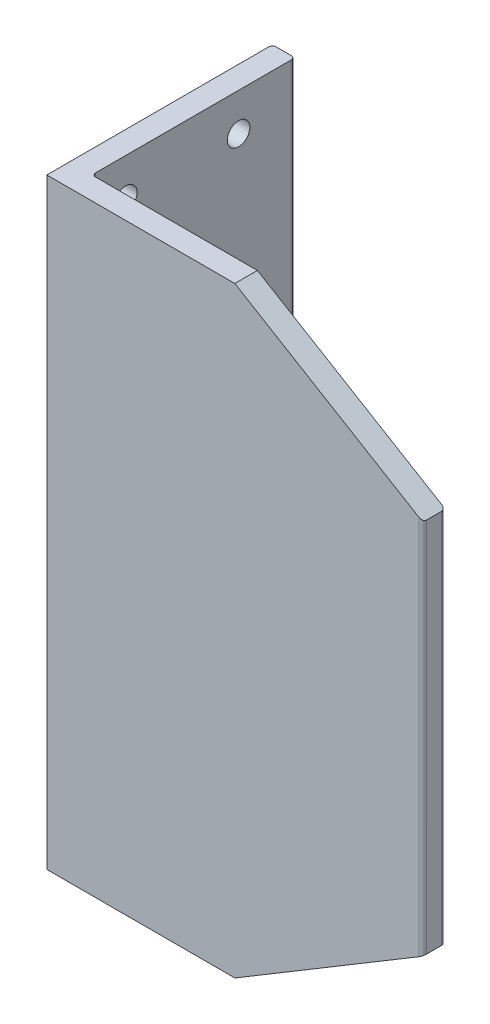
ISO-10303-21;
HEADER;
FILE_DESCRIPTION(('STEP AP214'),'2;1');
FILE_NAME('part.step','',(''),(''),'','','');
FILE_SCHEMA(('AUTOMOTIVE_DESIGN { 1 0 10303 214 1 1 1 1 }'));
ENDSEC;
DATA;
#1=APPLICATION_CONTEXT('core data for automotive mechanical design processes');
#2=APPLICATION_PROTOCOL_DEFINITION('international standard','automotive_design',2000,#1);
#3=PRODUCT_CONTEXT('',#1,'mechanical');
#4=PRODUCT('Part','Part','',(#3));
#5=PRODUCT_RELATED_PRODUCT_CATEGORY('part','',(#4));
#6=PRODUCT_DEFINITION_FORMATION('','',#4);
#7=PRODUCT_DEFINITION_CONTEXT('part definition',#1,'design');
#8=PRODUCT_DEFINITION('design','',#6,#7);
#9=PRODUCT_DEFINITION_SHAPE('','',#8);
#10=(LENGTH_UNIT() NAMED_UNIT(*) SI_UNIT(.MILLI.,.METRE.));
#11=(NAMED_UNIT(*) PLANE_ANGLE_UNIT() SI_UNIT($,.RADIAN.));
#12=(NAMED_UNIT(*) SI_UNIT($,.STERADIAN.) SOLID_ANGLE_UNIT());
#13=UNCERTAINTY_MEASURE_WITH_UNIT(LENGTH_MEASURE(1.E-05),#10,'distance_accuracy_value','');
#14=(GEOMETRIC_REPRESENTATION_CONTEXT(3) GLOBAL_UNCERTAINTY_ASSIGNED_CONTEXT((#13)) GLOBAL_UNIT_ASSIGNED_CONTEXT((#10,
#11,#12)) REPRESENTATION_CONTEXT('',''));
#15=CARTESIAN_POINT('',(0.,0.,0.));
#16=DIRECTION('',(0.,0.,1.));
#17=DIRECTION('',(1.,0.,0.));
#18=AXIS2_PLACEMENT_3D('',#15,#16,#17);
#19=CARTESIAN_POINT('',(7.00000000000001,160.,-6.));
#20=DIRECTION('',(0.,0.,1.));
#21=DIRECTION('',(1.,0.,0.));
#22=AXIS2_PLACEMENT_3D('',#19,#20,#21);
#23=PLANE('',#22);
#24=DIRECTION('',(0.,-1.,0.));
#25=VECTOR('',#24,1.);
#26=CARTESIAN_POINT('',(99.,160.,-6.));
#27=LINE('',#26,#25);
#28=CARTESIAN_POINT('',(99.,77.,-6.));
#29=VERTEX_POINT('',#28);
#30=CARTESIAN_POINT('',(99.,29.4,-6.));
#31=VERTEX_POINT('',#30);
#32=EDGE_CURVE('E182',#29,#31,#27,.T.);
#33=ORIENTED_EDGE('',*,*,#32,.T.);
#34=DIRECTION('',(-0.857492925712544,-0.514495755427526,0.));
#35=VECTOR('',#34,1.);
#36=CARTESIAN_POINT('',(88.9705882352941,23.3823529411765,-6.));
#37=LINE('',#36,#35);
#38=CARTESIAN_POINT('',(50.,0.,-6.));
#39=VERTEX_POINT('',#38);
#40=EDGE_CURVE('E159',#31,#39,#37,.T.);
#41=ORIENTED_EDGE('',*,*,#40,.T.);
#42=DIRECTION('',(-1.,0.,0.));
#43=VECTOR('',#42,1.);
#44=CARTESIAN_POINT('',(7.00000000000001,0.,-6.));
#45=LINE('',#44,#43);
#46=CARTESIAN_POINT('',(7.00000000000001,0.,-6.));
#47=VERTEX_POINT('',#46);
#48=EDGE_CURVE('E223',#39,#47,#45,.T.);
#49=ORIENTED_EDGE('',*,*,#48,.T.);
#50=DIRECTION('',(0.,-1.,0.));
#51=VECTOR('',#50,1.);
#52=CARTESIAN_POINT('',(7.00000000000001,160.,-6.));
#53=LINE('',#52,#51);
#54=CARTESIAN_POINT('',(7.00000000000001,77.,-6.));
#55=VERTEX_POINT('',#54);
#56=EDGE_CURVE('E186',#55,#47,#53,.T.);
#57=ORIENTED_EDGE('',*,*,#56,.F.);
#58=DIRECTION('',(-1.,0.,0.));
#59=VECTOR('',#58,1.);
#60=CARTESIAN_POINT('',(7.00000000000001,77.,-6.));
#61=LINE('',#60,#59);
#62=EDGE_CURVE('E256',#29,#55,#61,.T.);
#63=ORIENTED_EDGE('',*,*,#62,.F.);
#64=EDGE_LOOP('',(#33,#41,#49,#57,#63));
#65=FACE_BOUND('',#64,.T.);
#66=ADVANCED_FACE('F34',(#65),#23,.F.);
#67=CARTESIAN_POINT('',(7.00000000000001,160.,-7.));
#68=DIRECTION('',(0.,-1.,0.));
#69=DIRECTION('',(0.,0.,-1.));
#70=AXIS2_PLACEMENT_3D('',#67,#68,#69);
#71=CYLINDRICAL_SURFACE('',#70,1.);
#72=CARTESIAN_POINT('',(7.00000000000001,77.,-7.));
#73=DIRECTION('',(0.,1.,0.));
#74=DIRECTION('',(0.,0.,1.));
#75=AXIS2_PLACEMENT_3D('',#72,#73,#74);
#76=CIRCLE('',#75,1.);
#77=CARTESIAN_POINT('',(6.00000000000001,77.,-7.00000000000001));
#78=VERTEX_POINT('',#77);
#79=EDGE_CURVE('E258',#55,#78,#76,.F.);
#80=ORIENTED_EDGE('',*,*,#79,.F.);
#81=ORIENTED_EDGE('',*,*,#56,.T.);
#82=CARTESIAN_POINT('',(7.00000000000001,0.,-7.));
#83=DIRECTION('',(0.,-1.,0.));
#84=DIRECTION('',(0.,0.,1.));
#85=AXIS2_PLACEMENT_3D('',#82,#83,#84);
#86=CIRCLE('',#85,1.);
#87=CARTESIAN_POINT('',(6.00000000000001,0.,-7.00000000000001));
#88=VERTEX_POINT('',#87);
#89=EDGE_CURVE('E220',#47,#88,#86,.T.);
#90=ORIENTED_EDGE('',*,*,#89,.T.);
#91=DIRECTION('',(0.,-1.,0.));
#92=VECTOR('',#91,1.);
#93=CARTESIAN_POINT('',(6.00000000000001,160.,-7.00000000000001));
#94=LINE('',#93,#92);
#95=EDGE_CURVE('E190',#78,#88,#94,.T.);
#96=ORIENTED_EDGE('',*,*,#95,.F.);
#97=EDGE_LOOP('',(#80,#81,#90,#96));
#98=FACE_BOUND('',#97,.T.);
#99=ADVANCED_FACE('F385',(#98),#71,.F.);
#100=CARTESIAN_POINT('',(6.,160.,-59.));
#101=DIRECTION('',(-1.,0.,0.));
#102=DIRECTION('',(0.,0.,1.));
#103=AXIS2_PLACEMENT_3D('',#100,#101,#102);
#104=PLANE('',#103);
#105=CARTESIAN_POINT('',(6.,10.,-45.));
#106=DIRECTION('',(-1.,0.,0.));
#107=DIRECTION('',(0.,0.,1.));
#108=AXIS2_PLACEMENT_3D('',#105,#106,#107);
#109=CIRCLE('',#108,3.);
#110=CARTESIAN_POINT('',(6.,10.,-42.));
#111=VERTEX_POINT('',#110);
#112=EDGE_CURVE('E301',#111,#111,#109,.T.);
#113=ORIENTED_EDGE('',*,*,#112,.T.);
#114=EDGE_LOOP('',(#113));
#115=FACE_BOUND('',#114,.T.);
#116=CARTESIAN_POINT('',(6.00000000000001,10.,-15.));
#117=DIRECTION('',(-1.,0.,0.));
#118=DIRECTION('',(0.,0.,1.));
#119=AXIS2_PLACEMENT_3D('',#116,#117,#118);
#120=CIRCLE('',#119,2.99999999999999);
#121=CARTESIAN_POINT('',(6.00000000000001,10.,-12.));
#122=VERTEX_POINT('',#121);
#123=EDGE_CURVE('E295',#122,#122,#120,.T.);
#124=ORIENTED_EDGE('',*,*,#123,.T.);
#125=EDGE_LOOP('',(#124));
#126=FACE_BOUND('',#125,.T.);
#127=DIRECTION('',(0.,0.,-1.));
#128=VECTOR('',#127,1.);
#129=CARTESIAN_POINT('',(6.,77.,-59.));
#130=LINE('',#129,#128);
#131=CARTESIAN_POINT('',(6.,77.,-59.));
#132=VERTEX_POINT('',#131);
#133=EDGE_CURVE('E260',#78,#132,#130,.T.);
#134=ORIENTED_EDGE('',*,*,#133,.F.);
#135=ORIENTED_EDGE('',*,*,#95,.T.);
#136=DIRECTION('',(0.,0.,-1.));
#137=VECTOR('',#136,1.);
#138=CARTESIAN_POINT('',(6.,0.,-59.));
#139=LINE('',#138,#137);
#140=CARTESIAN_POINT('',(6.,0.,-59.));
#141=VERTEX_POINT('',#140);
#142=EDGE_CURVE('E217',#88,#141,#139,.T.);
#143=ORIENTED_EDGE('',*,*,#142,.T.);
#144=DIRECTION('',(0.,-1.,0.));
#145=VECTOR('',#144,1.);
#146=CARTESIAN_POINT('',(6.,160.,-59.));
#147=LINE('',#146,#145);
#148=EDGE_CURVE('E194',#132,#141,#147,.T.);
#149=ORIENTED_EDGE('',*,*,#148,.F.);
#150=EDGE_LOOP('',(#134,#135,#143,#149));
#151=FACE_BOUND('',#150,.T.);
#152=ADVANCED_FACE('F381',(#115,#126,#151),#104,.F.);
#153=CARTESIAN_POINT('',(99.,160.,0.));
#154=DIRECTION('',(0.,0.,-1.));
#155=DIRECTION('',(-1.,0.,0.));
#156=AXIS2_PLACEMENT_3D('',#153,#154,#155);
#157=PLANE('',#156);
#158=DIRECTION('',(1.,0.,0.));
#159=VECTOR('',#158,1.);
#160=CARTESIAN_POINT('',(99.,0.,0.));
#161=LINE('',#160,#159);
#162=CARTESIAN_POINT('',(0.,0.,0.));
#163=VERTEX_POINT('',#162);
#164=CARTESIAN_POINT('',(50.,0.,0.));
#165=VERTEX_POINT('',#164);
#166=EDGE_CURVE('E167',#163,#165,#161,.T.);
#167=ORIENTED_EDGE('',*,*,#166,.T.);
#168=DIRECTION('',(-0.857492925712544,-0.514495755427526,0.));
#169=VECTOR('',#168,1.);
#170=CARTESIAN_POINT('',(50.,0.,0.));
#171=LINE('',#170,#169);
#172=CARTESIAN_POINT('',(99.,29.4,0.));
#173=VERTEX_POINT('',#172);
#174=EDGE_CURVE('E48',#173,#165,#171,.T.);
#175=ORIENTED_EDGE('',*,*,#174,.F.);
#176=DIRECTION('',(0.,-1.,0.));
#177=VECTOR('',#176,1.);
#178=CARTESIAN_POINT('',(99.,160.,0.));
#179=LINE('',#178,#177);
#180=CARTESIAN_POINT('',(99.,130.6,0.));
#181=VERTEX_POINT('',#180);
#182=EDGE_CURVE('E165',#181,#173,#179,.T.);
#183=ORIENTED_EDGE('',*,*,#182,.F.);
#184=DIRECTION('',(0.857492925712544,-0.514495755427526,0.));
#185=VECTOR('',#184,1.);
#186=CARTESIAN_POINT('',(50.,160.,0.));
#187=LINE('',#186,#185);
#188=CARTESIAN_POINT('',(50.,160.,0.));
#189=VERTEX_POINT('',#188);
#190=EDGE_CURVE('E158',#189,#181,#187,.T.);
#191=ORIENTED_EDGE('',*,*,#190,.F.);
#192=DIRECTION('',(1.,0.,0.));
#193=VECTOR('',#192,1.);
#194=CARTESIAN_POINT('',(99.,160.,0.));
#195=LINE('',#194,#193);
#196=CARTESIAN_POINT('',(0.,160.,0.));
#197=VERTEX_POINT('',#196);
#198=EDGE_CURVE('E208',#197,#189,#195,.T.);
#199=ORIENTED_EDGE('',*,*,#198,.F.);
#200=DIRECTION('',(0.,-1.,0.));
#201=VECTOR('',#200,1.);
#202=CARTESIAN_POINT('',(0.,160.,0.));
#203=LINE('',#202,#201);
#204=EDGE_CURVE('E202',#197,#163,#203,.T.);
#205=ORIENTED_EDGE('',*,*,#204,.T.);
#206=EDGE_LOOP('',(#167,#175,#183,#191,#199,#205));
#207=FACE_BOUND('',#206,.T.);
#208=ADVANCED_FACE('F36',(#207),#157,.F.);
#209=CARTESIAN_POINT('',(99.,160.,-1.));
#210=DIRECTION('',(0.,-1.,0.));
#211=DIRECTION('',(0.,0.,-1.));
#212=AXIS2_PLACEMENT_3D('',#209,#210,#211);
#213=CYLINDRICAL_SURFACE('',#212,1.);
#214=ORIENTED_EDGE('',*,*,#182,.T.);
#215=CARTESIAN_POINT('',(99.,29.4,-1.));
#216=DIRECTION('',(-0.514495755427526,0.857492925712544,0.));
#217=DIRECTION('',(-0.857492925712544,-0.514495755427526,0.));
#218=AXIS2_PLACEMENT_3D('',#215,#216,#217);
#219=ELLIPSE('',#218,1.16619037896906,1.);
#220=CARTESIAN_POINT('',(100.,30.,-1.00000000000001));
#221=VERTEX_POINT('',#220);
#222=EDGE_CURVE('E150',#173,#221,#219,.T.);
#223=ORIENTED_EDGE('',*,*,#222,.T.);
#224=DIRECTION('',(0.,-1.,0.));
#225=VECTOR('',#224,1.);
#226=CARTESIAN_POINT('',(100.,160.,-1.00000000000001));
#227=LINE('',#226,#225);
#228=CARTESIAN_POINT('',(100.,130.,-1.00000000000001));
#229=VERTEX_POINT('',#228);
#230=EDGE_CURVE('E173',#229,#221,#227,.T.);
#231=ORIENTED_EDGE('',*,*,#230,.F.);
#232=CARTESIAN_POINT('',(99.,130.6,-1.));
#233=DIRECTION('',(-0.514495755427526,-0.857492925712544,0.));
#234=DIRECTION('',(0.857492925712544,-0.514495755427526,0.));
#235=AXIS2_PLACEMENT_3D('',#232,#233,#234);
#236=ELLIPSE('',#235,1.16619037896906,1.);
#237=EDGE_CURVE('E172',#229,#181,#236,.T.);
#238=ORIENTED_EDGE('',*,*,#237,.T.);
#239=EDGE_LOOP('',(#214,#223,#231,#238));
#240=FACE_BOUND('',#239,.T.);
#241=ADVANCED_FACE('F171',(#240),#213,.T.);
#242=CARTESIAN_POINT('',(100.,160.,-4.99999999999999));
#243=DIRECTION('',(-1.,0.,0.));
#244=DIRECTION('',(0.,0.,1.));
#245=AXIS2_PLACEMENT_3D('',#242,#243,#244);
#246=PLANE('',#245);
#247=ORIENTED_EDGE('',*,*,#230,.T.);
#248=DIRECTION('',(0.,0.,1.));
#249=VECTOR('',#248,1.);
#250=CARTESIAN_POINT('',(100.,30.,-60.));
#251=LINE('',#250,#249);
#252=CARTESIAN_POINT('',(100.,30.,-5.));
#253=VERTEX_POINT('',#252);
#254=EDGE_CURVE('E153',#253,#221,#251,.T.);
#255=ORIENTED_EDGE('',*,*,#254,.F.);
#256=DIRECTION('',(0.,-1.,0.));
#257=VECTOR('',#256,1.);
#258=CARTESIAN_POINT('',(100.,160.,-4.99999999999999));
#259=LINE('',#258,#257);
#260=CARTESIAN_POINT('',(100.,130.,-5.));
#261=VERTEX_POINT('',#260);
#262=EDGE_CURVE('E175',#261,#253,#259,.T.);
#263=ORIENTED_EDGE('',*,*,#262,.F.);
#264=DIRECTION('',(0.,0.,1.));
#265=VECTOR('',#264,1.);
#266=CARTESIAN_POINT('',(100.,130.,-60.));
#267=LINE('',#266,#265);
#268=EDGE_CURVE('E274',#261,#229,#267,.T.);
#269=ORIENTED_EDGE('',*,*,#268,.T.);
#270=EDGE_LOOP('',(#247,#255,#263,#269));
#271=FACE_BOUND('',#270,.T.);
#272=ADVANCED_FACE('F347',(#271),#246,.F.);
#273=CARTESIAN_POINT('',(99.,160.,-5.));
#274=DIRECTION('',(0.,-1.,0.));
#275=DIRECTION('',(0.,0.,-1.));
#276=AXIS2_PLACEMENT_3D('',#273,#274,#275);
#277=CYLINDRICAL_SURFACE('',#276,1.);
#278=ORIENTED_EDGE('',*,*,#262,.T.);
#279=CARTESIAN_POINT('',(99.,29.4,-5.));
#280=DIRECTION('',(-0.514495755427526,0.857492925712544,0.));
#281=DIRECTION('',(-0.857492925712544,-0.514495755427526,0.));
#282=AXIS2_PLACEMENT_3D('',#279,#280,#281);
#283=ELLIPSE('',#282,1.16619037896906,1.);
#284=EDGE_CURVE('E280',#253,#31,#283,.T.);
#285=ORIENTED_EDGE('',*,*,#284,.T.);
#286=ORIENTED_EDGE('',*,*,#32,.F.);
#287=DIRECTION('',(0.,-1.,0.));
#288=VECTOR('',#287,1.);
#289=CARTESIAN_POINT('',(99.,160.,-6.));
#290=LINE('',#289,#288);
#291=CARTESIAN_POINT('',(99.,83.,-6.));
#292=VERTEX_POINT('',#291);
#293=EDGE_CURVE('E226',#29,#292,#290,.F.);
#294=ORIENTED_EDGE('',*,*,#293,.T.);
#295=CARTESIAN_POINT('',(99.,130.6,-6.));
#296=VERTEX_POINT('',#295);
#297=EDGE_CURVE('E180',#296,#292,#27,.T.);
#298=ORIENTED_EDGE('',*,*,#297,.F.);
#299=CARTESIAN_POINT('',(99.,130.6,-5.));
#300=DIRECTION('',(-0.514495755427526,-0.857492925712544,0.));
#301=DIRECTION('',(0.857492925712544,-0.514495755427526,0.));
#302=AXIS2_PLACEMENT_3D('',#299,#300,#301);
#303=ELLIPSE('',#302,1.16619037896906,1.);
#304=EDGE_CURVE('E270',#296,#261,#303,.T.);
#305=ORIENTED_EDGE('',*,*,#304,.T.);
#306=EDGE_LOOP('',(#278,#285,#286,#294,#298,#305));
#307=FACE_BOUND('',#306,.T.);
#308=ADVANCED_FACE('F343',(#307),#277,.T.);
#309=DIRECTION('',(-1.,0.,0.));
#310=VECTOR('',#309,1.);
#311=CARTESIAN_POINT('',(7.00000000000001,160.,-6.));
#312=LINE('',#311,#310);
#313=CARTESIAN_POINT('',(50.,160.,-6.));
#314=VERTEX_POINT('',#313);
#315=CARTESIAN_POINT('',(7.00000000000001,160.,-6.));
#316=VERTEX_POINT('',#315);
#317=EDGE_CURVE('E238',#314,#316,#312,.T.);
#318=ORIENTED_EDGE('',*,*,#317,.F.);
#319=DIRECTION('',(0.857492925712544,-0.514495755427526,0.));
#320=VECTOR('',#319,1.);
#321=CARTESIAN_POINT('',(18.3823529411765,178.970588235294,-6.));
#322=LINE('',#321,#320);
#323=EDGE_CURVE('E56',#314,#296,#322,.T.);
#324=ORIENTED_EDGE('',*,*,#323,.T.);
#325=ORIENTED_EDGE('',*,*,#297,.T.);
#326=DIRECTION('',(-1.,0.,0.));
#327=VECTOR('',#326,1.);
#328=CARTESIAN_POINT('',(7.00000000000001,83.,-6.));
#329=LINE('',#328,#327);
#330=CARTESIAN_POINT('',(7.00000000000001,83.,-6.));
#331=VERTEX_POINT('',#330);
#332=EDGE_CURVE('E247',#292,#331,#329,.T.);
#333=ORIENTED_EDGE('',*,*,#332,.T.);
#334=EDGE_CURVE('E183',#316,#331,#53,.T.);
#335=ORIENTED_EDGE('',*,*,#334,.F.);
#336=EDGE_LOOP('',(#318,#324,#325,#333,#335));
#337=FACE_BOUND('',#336,.T.);
#338=ADVANCED_FACE('F352',(#337),#23,.F.);
#339=ORIENTED_EDGE('',*,*,#334,.T.);
#340=CARTESIAN_POINT('',(7.00000000000001,83.,-7.));
#341=DIRECTION('',(0.,1.,0.));
#342=DIRECTION('',(0.,0.,1.));
#343=AXIS2_PLACEMENT_3D('',#340,#341,#342);
#344=CIRCLE('',#343,1.);
#345=CARTESIAN_POINT('',(6.00000000000001,83.,-7.00000000000001));
#346=VERTEX_POINT('',#345);
#347=EDGE_CURVE('E250',#331,#346,#344,.F.);
#348=ORIENTED_EDGE('',*,*,#347,.T.);
#349=CARTESIAN_POINT('',(6.00000000000001,160.,-7.00000000000001));
#350=VERTEX_POINT('',#349);
#351=EDGE_CURVE('E187',#350,#346,#94,.T.);
#352=ORIENTED_EDGE('',*,*,#351,.F.);
#353=CARTESIAN_POINT('',(7.00000000000001,160.,-7.));
#354=DIRECTION('',(0.,-1.,0.));
#355=DIRECTION('',(0.,0.,1.));
#356=AXIS2_PLACEMENT_3D('',#353,#354,#355);
#357=CIRCLE('',#356,1.);
#358=EDGE_CURVE('E236',#316,#350,#357,.T.);
#359=ORIENTED_EDGE('',*,*,#358,.F.);
#360=EDGE_LOOP('',(#339,#348,#352,#359));
#361=FACE_BOUND('',#360,.T.);
#362=ADVANCED_FACE('F370',(#361),#71,.F.);
#363=CARTESIAN_POINT('',(6.00000000000001,150.,-15.));
#364=DIRECTION('',(-1.,0.,0.));
#365=DIRECTION('',(0.,0.,1.));
#366=AXIS2_PLACEMENT_3D('',#363,#364,#365);
#367=CIRCLE('',#366,2.99999999999999);
#368=CARTESIAN_POINT('',(6.00000000000001,150.,-12.));
#369=VERTEX_POINT('',#368);
#370=EDGE_CURVE('E289',#369,#369,#367,.T.);
#371=ORIENTED_EDGE('',*,*,#370,.T.);
#372=EDGE_LOOP('',(#371));
#373=FACE_BOUND('',#372,.T.);
#374=CARTESIAN_POINT('',(6.,150.,-45.));
#375=DIRECTION('',(-1.,0.,0.));
#376=DIRECTION('',(0.,0.,1.));
#377=AXIS2_PLACEMENT_3D('',#374,#375,#376);
#378=CIRCLE('',#377,3.);
#379=CARTESIAN_POINT('',(6.,150.,-42.));
#380=VERTEX_POINT('',#379);
#381=EDGE_CURVE('E168',#380,#380,#378,.T.);
#382=ORIENTED_EDGE('',*,*,#381,.T.);
#383=EDGE_LOOP('',(#382));
#384=FACE_BOUND('',#383,.T.);
#385=ORIENTED_EDGE('',*,*,#351,.T.);
#386=DIRECTION('',(0.,0.,-1.));
#387=VECTOR('',#386,1.);
#388=CARTESIAN_POINT('',(6.,83.,-59.));
#389=LINE('',#388,#387);
#390=CARTESIAN_POINT('',(6.,83.,-59.));
#391=VERTEX_POINT('',#390);
#392=EDGE_CURVE('E253',#346,#391,#389,.T.);
#393=ORIENTED_EDGE('',*,*,#392,.T.);
#394=CARTESIAN_POINT('',(6.,160.,-59.));
#395=VERTEX_POINT('',#394);
#396=EDGE_CURVE('E191',#395,#391,#147,.T.);
#397=ORIENTED_EDGE('',*,*,#396,.F.);
#398=DIRECTION('',(0.,0.,-1.));
#399=VECTOR('',#398,1.);
#400=CARTESIAN_POINT('',(6.,160.,-59.));
#401=LINE('',#400,#399);
#402=EDGE_CURVE('E234',#350,#395,#401,.T.);
#403=ORIENTED_EDGE('',*,*,#402,.F.);
#404=EDGE_LOOP('',(#385,#393,#397,#403));
#405=FACE_BOUND('',#404,.T.);
#406=ADVANCED_FACE('F367',(#373,#384,#405),#104,.F.);
#407=CARTESIAN_POINT('',(5.,160.,-59.));
#408=DIRECTION('',(0.,-1.,0.));
#409=DIRECTION('',(0.,0.,-1.));
#410=AXIS2_PLACEMENT_3D('',#407,#408,#409);
#411=CYLINDRICAL_SURFACE('',#410,1.);
#412=CARTESIAN_POINT('',(5.,0.,-59.));
#413=DIRECTION('',(0.,1.,0.));
#414=DIRECTION('',(0.,0.,-1.));
#415=AXIS2_PLACEMENT_3D('',#412,#413,#414);
#416=CIRCLE('',#415,1.);
#417=CARTESIAN_POINT('',(4.99999999999999,0.,-60.));
#418=VERTEX_POINT('',#417);
#419=EDGE_CURVE('E215',#141,#418,#416,.T.);
#420=ORIENTED_EDGE('',*,*,#419,.T.);
#421=DIRECTION('',(0.,-1.,0.));
#422=VECTOR('',#421,1.);
#423=CARTESIAN_POINT('',(4.99999999999999,160.,-60.));
#424=LINE('',#423,#422);
#425=CARTESIAN_POINT('',(4.99999999999999,160.,-60.));
#426=VERTEX_POINT('',#425);
#427=EDGE_CURVE('E195',#426,#418,#424,.T.);
#428=ORIENTED_EDGE('',*,*,#427,.F.);
#429=CARTESIAN_POINT('',(5.,160.,-59.));
#430=DIRECTION('',(0.,1.,0.));
#431=DIRECTION('',(0.,0.,-1.));
#432=AXIS2_PLACEMENT_3D('',#429,#430,#431);
#433=CIRCLE('',#432,1.);
#434=EDGE_CURVE('E232',#395,#426,#433,.T.);
#435=ORIENTED_EDGE('',*,*,#434,.F.);
#436=ORIENTED_EDGE('',*,*,#396,.T.);
#437=DIRECTION('',(0.,-1.,0.));
#438=VECTOR('',#437,1.);
#439=CARTESIAN_POINT('',(6.,160.,-59.));
#440=LINE('',#439,#438);
#441=EDGE_CURVE('E244',#391,#132,#440,.T.);
#442=ORIENTED_EDGE('',*,*,#441,.T.);
#443=ORIENTED_EDGE('',*,*,#148,.T.);
#444=EDGE_LOOP('',(#420,#428,#435,#436,#442,#443));
#445=FACE_BOUND('',#444,.T.);
#446=ADVANCED_FACE('F360',(#445),#411,.T.);
#447=CARTESIAN_POINT('',(1.00000000000001,160.,-60.));
#448=DIRECTION('',(0.,0.,1.));
#449=DIRECTION('',(1.,0.,0.));
#450=AXIS2_PLACEMENT_3D('',#447,#448,#449);
#451=PLANE('',#450);
#452=DIRECTION('',(-1.,0.,0.));
#453=VECTOR('',#452,1.);
#454=CARTESIAN_POINT('',(1.00000000000001,0.,-60.));
#455=LINE('',#454,#453);
#456=CARTESIAN_POINT('',(1.00000000000001,0.,-60.));
#457=VERTEX_POINT('',#456);
#458=EDGE_CURVE('E212',#418,#457,#455,.T.);
#459=ORIENTED_EDGE('',*,*,#458,.T.);
#460=DIRECTION('',(0.,-1.,0.));
#461=VECTOR('',#460,1.);
#462=CARTESIAN_POINT('',(1.00000000000001,160.,-60.));
#463=LINE('',#462,#461);
#464=CARTESIAN_POINT('',(1.00000000000001,160.,-60.));
#465=VERTEX_POINT('',#464);
#466=EDGE_CURVE('E198',#465,#457,#463,.T.);
#467=ORIENTED_EDGE('',*,*,#466,.F.);
#468=DIRECTION('',(-1.,0.,0.));
#469=VECTOR('',#468,1.);
#470=CARTESIAN_POINT('',(1.00000000000001,160.,-60.));
#471=LINE('',#470,#469);
#472=EDGE_CURVE('E230',#426,#465,#471,.T.);
#473=ORIENTED_EDGE('',*,*,#472,.F.);
#474=ORIENTED_EDGE('',*,*,#427,.T.);
#475=EDGE_LOOP('',(#459,#467,#473,#474));
#476=FACE_BOUND('',#475,.T.);
#477=ADVANCED_FACE('F376',(#476),#451,.F.);
#478=CARTESIAN_POINT('',(1.,160.,-59.));
#479=DIRECTION('',(0.,-1.,0.));
#480=DIRECTION('',(0.,0.,-1.));
#481=AXIS2_PLACEMENT_3D('',#478,#479,#480);
#482=CYLINDRICAL_SURFACE('',#481,1.);
#483=ORIENTED_EDGE('',*,*,#466,.T.);
#484=CARTESIAN_POINT('',(1.,0.,-59.));
#485=DIRECTION('',(0.,1.,0.));
#486=DIRECTION('',(0.,0.,-1.));
#487=AXIS2_PLACEMENT_3D('',#484,#485,#486);
#488=CIRCLE('',#487,1.);
#489=CARTESIAN_POINT('',(0.,0.,-59.));
#490=VERTEX_POINT('',#489);
#491=EDGE_CURVE('E209',#457,#490,#488,.T.);
#492=ORIENTED_EDGE('',*,*,#491,.T.);
#493=DIRECTION('',(0.,-1.,0.));
#494=VECTOR('',#493,1.);
#495=CARTESIAN_POINT('',(0.,160.,-59.));
#496=LINE('',#495,#494);
#497=CARTESIAN_POINT('',(0.,160.,-59.));
#498=VERTEX_POINT('',#497);
#499=EDGE_CURVE('E200',#498,#490,#496,.T.);
#500=ORIENTED_EDGE('',*,*,#499,.F.);
#501=CARTESIAN_POINT('',(1.,160.,-59.));
#502=DIRECTION('',(0.,1.,0.));
#503=DIRECTION('',(0.,0.,-1.));
#504=AXIS2_PLACEMENT_3D('',#501,#502,#503);
#505=CIRCLE('',#504,1.);
#506=EDGE_CURVE('E228',#465,#498,#505,.T.);
#507=ORIENTED_EDGE('',*,*,#506,.F.);
#508=EDGE_LOOP('',(#483,#492,#500,#507));
#509=FACE_BOUND('',#508,.T.);
#510=ADVANCED_FACE('F315',(#509),#482,.T.);
#511=CARTESIAN_POINT('',(0.,160.,0.));
#512=DIRECTION('',(1.,0.,0.));
#513=DIRECTION('',(0.,0.,-1.));
#514=AXIS2_PLACEMENT_3D('',#511,#512,#513);
#515=PLANE('',#514);
#516=CARTESIAN_POINT('',(0.,10.,-45.));
#517=DIRECTION('',(-1.,0.,0.));
#518=DIRECTION('',(0.,0.,-1.));
#519=AXIS2_PLACEMENT_3D('',#516,#517,#518);
#520=CIRCLE('',#519,3.);
#521=CARTESIAN_POINT('',(0.,10.,-48.));
#522=VERTEX_POINT('',#521);
#523=EDGE_CURVE('E304',#522,#522,#520,.T.);
#524=ORIENTED_EDGE('',*,*,#523,.F.);
#525=EDGE_LOOP('',(#524));
#526=FACE_BOUND('',#525,.T.);
#527=CARTESIAN_POINT('',(0.,10.,-15.));
#528=DIRECTION('',(-1.,0.,0.));
#529=DIRECTION('',(0.,0.,-1.));
#530=AXIS2_PLACEMENT_3D('',#527,#528,#529);
#531=CIRCLE('',#530,2.99999999999999);
#532=CARTESIAN_POINT('',(0.,10.,-18.));
#533=VERTEX_POINT('',#532);
#534=EDGE_CURVE('E298',#533,#533,#531,.T.);
#535=ORIENTED_EDGE('',*,*,#534,.F.);
#536=EDGE_LOOP('',(#535));
#537=FACE_BOUND('',#536,.T.);
#538=CARTESIAN_POINT('',(0.,150.,-15.));
#539=DIRECTION('',(-1.,0.,0.));
#540=DIRECTION('',(0.,0.,1.));
#541=AXIS2_PLACEMENT_3D('',#538,#539,#540);
#542=CIRCLE('',#541,2.99999999999999);
#543=CARTESIAN_POINT('',(0.,150.,-12.));
#544=VERTEX_POINT('',#543);
#545=EDGE_CURVE('E292',#544,#544,#542,.T.);
#546=ORIENTED_EDGE('',*,*,#545,.F.);
#547=EDGE_LOOP('',(#546));
#548=FACE_BOUND('',#547,.T.);
#549=CARTESIAN_POINT('',(0.,150.,-45.));
#550=DIRECTION('',(-1.,0.,0.));
#551=DIRECTION('',(0.,0.,1.));
#552=AXIS2_PLACEMENT_3D('',#549,#550,#551);
#553=CIRCLE('',#552,3.);
#554=CARTESIAN_POINT('',(0.,150.,-42.));
#555=VERTEX_POINT('',#554);
#556=EDGE_CURVE('E286',#555,#555,#553,.T.);
#557=ORIENTED_EDGE('',*,*,#556,.F.);
#558=EDGE_LOOP('',(#557));
#559=FACE_BOUND('',#558,.T.);
#560=ORIENTED_EDGE('',*,*,#499,.T.);
#561=DIRECTION('',(0.,0.,1.));
#562=VECTOR('',#561,1.);
#563=CARTESIAN_POINT('',(0.,0.,0.));
#564=LINE('',#563,#562);
#565=EDGE_CURVE('E205',#490,#163,#564,.T.);
#566=ORIENTED_EDGE('',*,*,#565,.T.);
#567=ORIENTED_EDGE('',*,*,#204,.F.);
#568=DIRECTION('',(0.,0.,1.));
#569=VECTOR('',#568,1.);
#570=CARTESIAN_POINT('',(0.,160.,0.));
#571=LINE('',#570,#569);
#572=EDGE_CURVE('E204',#498,#197,#571,.T.);
#573=ORIENTED_EDGE('',*,*,#572,.F.);
#574=EDGE_LOOP('',(#560,#566,#567,#573));
#575=FACE_BOUND('',#574,.T.);
#576=ADVANCED_FACE('F311',(#526,#537,#548,#559,#575),#515,.F.);
#577=CARTESIAN_POINT('',(1.,160.,-59.));
#578=DIRECTION('',(0.,-1.,0.));
#579=DIRECTION('',(0.,0.,-1.));
#580=AXIS2_PLACEMENT_3D('',#577,#578,#579);
#581=PLANE('',#580);
#582=ORIENTED_EDGE('',*,*,#198,.T.);
#583=DIRECTION('',(0.,0.,-1.));
#584=VECTOR('',#583,1.);
#585=CARTESIAN_POINT('',(50.,160.,-59.));
#586=LINE('',#585,#584);
#587=EDGE_CURVE('E42',#189,#314,#586,.T.);
#588=ORIENTED_EDGE('',*,*,#587,.T.);
#589=ORIENTED_EDGE('',*,*,#317,.T.);
#590=ORIENTED_EDGE('',*,*,#358,.T.);
#591=ORIENTED_EDGE('',*,*,#402,.T.);
#592=ORIENTED_EDGE('',*,*,#434,.T.);
#593=ORIENTED_EDGE('',*,*,#472,.T.);
#594=ORIENTED_EDGE('',*,*,#506,.T.);
#595=ORIENTED_EDGE('',*,*,#572,.T.);
#596=EDGE_LOOP('',(#582,#588,#589,#590,#591,#592,#593,#594,#595));
#597=FACE_BOUND('',#596,.T.);
#598=ADVANCED_FACE('F314',(#597),#581,.F.);
#599=CARTESIAN_POINT('',(1.,0.,-59.));
#600=DIRECTION('',(0.,-1.,0.));
#601=DIRECTION('',(0.,0.,-1.));
#602=AXIS2_PLACEMENT_3D('',#599,#600,#601);
#603=PLANE('',#602);
#604=DIRECTION('',(0.,0.,-1.));
#605=VECTOR('',#604,1.);
#606=CARTESIAN_POINT('',(50.,0.,-59.));
#607=LINE('',#606,#605);
#608=EDGE_CURVE('E11',#165,#39,#607,.T.);
#609=ORIENTED_EDGE('',*,*,#608,.F.);
#610=ORIENTED_EDGE('',*,*,#166,.F.);
#611=ORIENTED_EDGE('',*,*,#565,.F.);
#612=ORIENTED_EDGE('',*,*,#491,.F.);
#613=ORIENTED_EDGE('',*,*,#458,.F.);
#614=ORIENTED_EDGE('',*,*,#419,.F.);
#615=ORIENTED_EDGE('',*,*,#142,.F.);
#616=ORIENTED_EDGE('',*,*,#89,.F.);
#617=ORIENTED_EDGE('',*,*,#48,.F.);
#618=EDGE_LOOP('',(#609,#610,#611,#612,#613,#614,#615,#616,#617));
#619=FACE_BOUND('',#618,.T.);
#620=ADVANCED_FACE('F333',(#619),#603,.T.);
#621=CARTESIAN_POINT('',(6.,80.,-59.));
#622=DIRECTION('',(-0.495132530466823,0.,0.868817459121029));
#623=DIRECTION('',(0.868817459121029,0.,0.495132530466823));
#624=AXIS2_PLACEMENT_3D('',#621,#622,#623);
#625=PLANE('',#624);
#626=ORIENTED_EDGE('',*,*,#293,.F.);
#627=DIRECTION('',(0.868817459121029,0.,0.495132530466823));
#628=VECTOR('',#627,1.);
#629=CARTESIAN_POINT('',(6.,77.,-59.));
#630=LINE('',#629,#628);
#631=EDGE_CURVE('E264',#132,#29,#630,.T.);
#632=ORIENTED_EDGE('',*,*,#631,.F.);
#633=ORIENTED_EDGE('',*,*,#441,.F.);
#634=DIRECTION('',(0.868817459121029,0.,0.495132530466823));
#635=VECTOR('',#634,1.);
#636=CARTESIAN_POINT('',(6.,83.,-59.));
#637=LINE('',#636,#635);
#638=EDGE_CURVE('E263',#391,#292,#637,.T.);
#639=ORIENTED_EDGE('',*,*,#638,.T.);
#640=EDGE_LOOP('',(#626,#632,#633,#639));
#641=FACE_BOUND('',#640,.T.);
#642=ADVANCED_FACE('F358',(#641),#625,.F.);
#643=CARTESIAN_POINT('',(50.,83.,-30.));
#644=DIRECTION('',(0.,1.,0.));
#645=DIRECTION('',(0.,0.,1.));
#646=AXIS2_PLACEMENT_3D('',#643,#644,#645);
#647=PLANE('',#646);
#648=ORIENTED_EDGE('',*,*,#332,.F.);
#649=ORIENTED_EDGE('',*,*,#638,.F.);
#650=ORIENTED_EDGE('',*,*,#392,.F.);
#651=ORIENTED_EDGE('',*,*,#347,.F.);
#652=EDGE_LOOP('',(#648,#649,#650,#651));
#653=FACE_BOUND('',#652,.T.);
#654=ADVANCED_FACE('F356',(#653),#647,.T.);
#655=CARTESIAN_POINT('',(50.,77.,-30.));
#656=DIRECTION('',(0.,1.,0.));
#657=DIRECTION('',(0.,0.,1.));
#658=AXIS2_PLACEMENT_3D('',#655,#656,#657);
#659=PLANE('',#658);
#660=ORIENTED_EDGE('',*,*,#631,.T.);
#661=ORIENTED_EDGE('',*,*,#62,.T.);
#662=ORIENTED_EDGE('',*,*,#79,.T.);
#663=ORIENTED_EDGE('',*,*,#133,.T.);
#664=EDGE_LOOP('',(#660,#661,#662,#663));
#665=FACE_BOUND('',#664,.T.);
#666=ADVANCED_FACE('F387',(#665),#659,.F.);
#667=CARTESIAN_POINT('',(50.,160.,-60.));
#668=DIRECTION('',(-0.514495755427526,-0.857492925712544,0.));
#669=DIRECTION('',(0.857492925712544,-0.514495755427526,0.));
#670=AXIS2_PLACEMENT_3D('',#667,#668,#669);
#671=PLANE('',#670);
#672=ORIENTED_EDGE('',*,*,#268,.F.);
#673=ORIENTED_EDGE('',*,*,#304,.F.);
#674=ORIENTED_EDGE('',*,*,#323,.F.);
#675=ORIENTED_EDGE('',*,*,#587,.F.);
#676=ORIENTED_EDGE('',*,*,#190,.T.);
#677=ORIENTED_EDGE('',*,*,#237,.F.);
#678=EDGE_LOOP('',(#672,#673,#674,#675,#676,#677));
#679=FACE_BOUND('',#678,.T.);
#680=ADVANCED_FACE('F348',(#679),#671,.F.);
#681=CARTESIAN_POINT('',(50.,0.,-60.));
#682=DIRECTION('',(-0.514495755427526,0.857492925712544,0.));
#683=DIRECTION('',(-0.857492925712544,-0.514495755427526,0.));
#684=AXIS2_PLACEMENT_3D('',#681,#682,#683);
#685=PLANE('',#684);
#686=ORIENTED_EDGE('',*,*,#174,.T.);
#687=ORIENTED_EDGE('',*,*,#608,.T.);
#688=ORIENTED_EDGE('',*,*,#40,.F.);
#689=ORIENTED_EDGE('',*,*,#284,.F.);
#690=ORIENTED_EDGE('',*,*,#254,.T.);
#691=ORIENTED_EDGE('',*,*,#222,.F.);
#692=EDGE_LOOP('',(#686,#687,#688,#689,#690,#691));
#693=FACE_BOUND('',#692,.T.);
#694=ADVANCED_FACE('F151',(#693),#685,.F.);
#695=CARTESIAN_POINT('',(10.,150.,-45.));
#696=DIRECTION('',(-1.,0.,0.));
#697=DIRECTION('',(0.,0.,1.));
#698=AXIS2_PLACEMENT_3D('',#695,#696,#697);
#699=CYLINDRICAL_SURFACE('',#698,3.);
#700=ORIENTED_EDGE('',*,*,#556,.T.);
#701=EDGE_LOOP('',(#700));
#702=FACE_BOUND('',#701,.T.);
#703=ORIENTED_EDGE('',*,*,#381,.F.);
#704=EDGE_LOOP('',(#703));
#705=FACE_BOUND('',#704,.T.);
#706=ADVANCED_FACE('F435',(#702,#705),#699,.F.);
#707=CARTESIAN_POINT('',(10.,150.,-15.));
#708=DIRECTION('',(-1.,0.,0.));
#709=DIRECTION('',(0.,0.,1.));
#710=AXIS2_PLACEMENT_3D('',#707,#708,#709);
#711=CYLINDRICAL_SURFACE('',#710,2.99999999999999);
#712=ORIENTED_EDGE('',*,*,#545,.T.);
#713=EDGE_LOOP('',(#712));
#714=FACE_BOUND('',#713,.T.);
#715=ORIENTED_EDGE('',*,*,#370,.F.);
#716=EDGE_LOOP('',(#715));
#717=FACE_BOUND('',#716,.T.);
#718=ADVANCED_FACE('F437',(#714,#717),#711,.F.);
#719=CARTESIAN_POINT('',(10.,10.,-15.));
#720=DIRECTION('',(-1.,0.,0.));
#721=DIRECTION('',(0.,0.,1.));
#722=AXIS2_PLACEMENT_3D('',#719,#720,#721);
#723=CYLINDRICAL_SURFACE('',#722,2.99999999999999);
#724=ORIENTED_EDGE('',*,*,#534,.T.);
#725=EDGE_LOOP('',(#724));
#726=FACE_BOUND('',#725,.T.);
#727=ORIENTED_EDGE('',*,*,#123,.F.);
#728=EDGE_LOOP('',(#727));
#729=FACE_BOUND('',#728,.T.);
#730=ADVANCED_FACE('F444',(#726,#729),#723,.F.);
#731=CARTESIAN_POINT('',(10.,10.,-45.));
#732=DIRECTION('',(-1.,0.,0.));
#733=DIRECTION('',(0.,0.,1.));
#734=AXIS2_PLACEMENT_3D('',#731,#732,#733);
#735=CYLINDRICAL_SURFACE('',#734,3.);
#736=ORIENTED_EDGE('',*,*,#523,.T.);
#737=EDGE_LOOP('',(#736));
#738=FACE_BOUND('',#737,.T.);
#739=ORIENTED_EDGE('',*,*,#112,.F.);
#740=EDGE_LOOP('',(#739));
#741=FACE_BOUND('',#740,.T.);
#742=ADVANCED_FACE('F308',(#738,#741),#735,.F.);
#743=CLOSED_SHELL('',(#66,#99,#152,#208,#241,#272,#308,#338,#362,#406,#446,#477,#510,#576,#598,
#620,#642,#654,#666,#680,#694,#706,#718,#730,#742));
#744=MANIFOLD_SOLID_BREP('B2',#743);
#745=ADVANCED_BREP_SHAPE_REPRESENTATION('',(#18,#744),#14);
#746=SHAPE_DEFINITION_REPRESENTATION(#9,#745);
ENDSEC;
END-ISO-10303-21;
